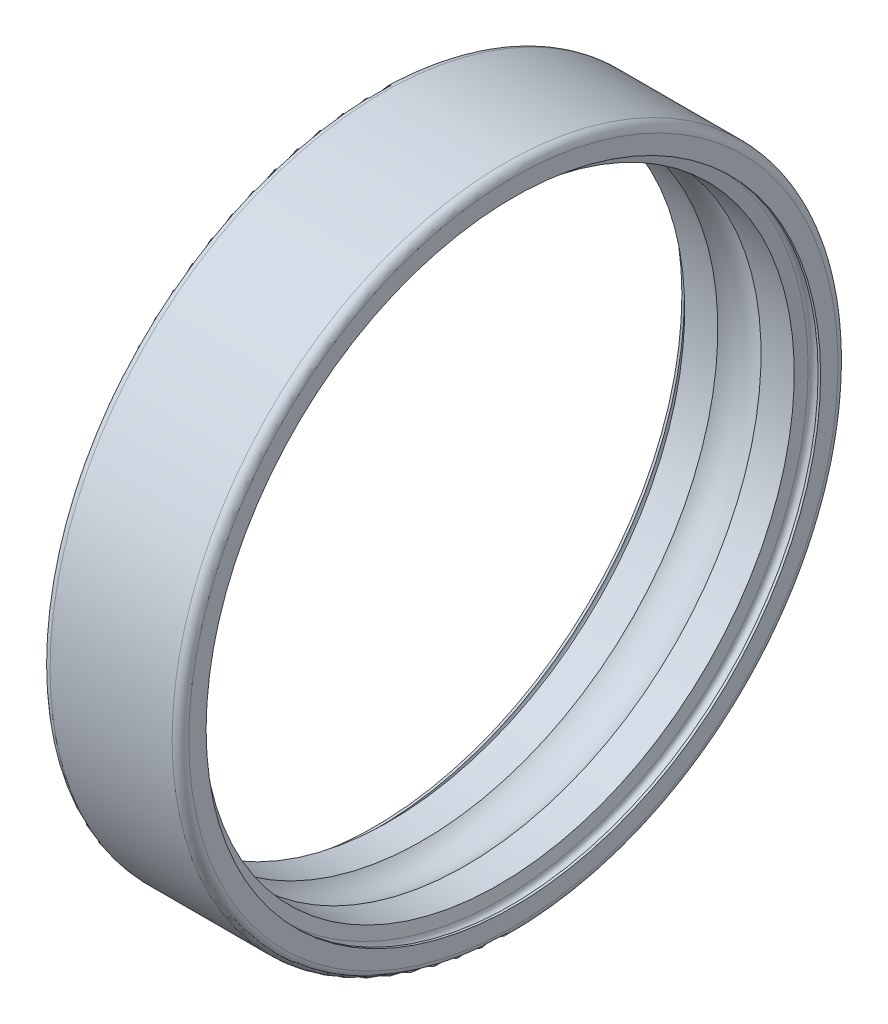
ISO-10303-21;
HEADER;
FILE_DESCRIPTION(('STEP AP214'),'2;1');
FILE_NAME('part.step','',(''),(''),'','','');
FILE_SCHEMA(('AUTOMOTIVE_DESIGN { 1 0 10303 214 1 1 1 1 }'));
ENDSEC;
DATA;
#1=APPLICATION_CONTEXT('core data for automotive mechanical design processes');
#2=APPLICATION_PROTOCOL_DEFINITION('international standard','automotive_design',2000,#1);
#3=PRODUCT_CONTEXT('',#1,'mechanical');
#4=PRODUCT('Part','Part','',(#3));
#5=PRODUCT_RELATED_PRODUCT_CATEGORY('part','',(#4));
#6=PRODUCT_DEFINITION_FORMATION('','',#4);
#7=PRODUCT_DEFINITION_CONTEXT('part definition',#1,'design');
#8=PRODUCT_DEFINITION('design','',#6,#7);
#9=PRODUCT_DEFINITION_SHAPE('','',#8);
#10=(LENGTH_UNIT() NAMED_UNIT(*) SI_UNIT(.MILLI.,.METRE.));
#11=(NAMED_UNIT(*) PLANE_ANGLE_UNIT() SI_UNIT($,.RADIAN.));
#12=(NAMED_UNIT(*) SI_UNIT($,.STERADIAN.) SOLID_ANGLE_UNIT());
#13=UNCERTAINTY_MEASURE_WITH_UNIT(LENGTH_MEASURE(1.E-05),#10,'distance_accuracy_value','');
#14=(GEOMETRIC_REPRESENTATION_CONTEXT(3) GLOBAL_UNCERTAINTY_ASSIGNED_CONTEXT((#13)) GLOBAL_UNIT_ASSIGNED_CONTEXT((#10,
#11,#12)) REPRESENTATION_CONTEXT('',''));
#15=CARTESIAN_POINT('',(0.,0.,0.));
#16=DIRECTION('',(0.,0.,1.));
#17=DIRECTION('',(1.,0.,0.));
#18=AXIS2_PLACEMENT_3D('',#15,#16,#17);
#19=CARTESIAN_POINT('',(0.,11.7,0.));
#20=DIRECTION('',(1.,0.,0.));
#21=DIRECTION('',(0.,0.,-1.));
#22=AXIS2_PLACEMENT_3D('',#19,#20,#21);
#23=PLANE('',#22);
#24=CARTESIAN_POINT('',(0.,0.,0.));
#25=DIRECTION('',(-1.,0.,0.));
#26=DIRECTION('',(0.,0.,1.));
#27=AXIS2_PLACEMENT_3D('',#24,#25,#26);
#28=CIRCLE('',#27,11.075);
#29=CARTESIAN_POINT('',(0.,0.,11.075));
#30=VERTEX_POINT('',#29);
#31=EDGE_CURVE('E79',#30,#30,#28,.T.);
#32=ORIENTED_EDGE('',*,*,#31,.F.);
#33=EDGE_LOOP('',(#32));
#34=FACE_BOUND('',#33,.T.);
#35=CARTESIAN_POINT('',(0.,0.,0.));
#36=DIRECTION('',(-1.,0.,0.));
#37=DIRECTION('',(0.,0.,1.));
#38=AXIS2_PLACEMENT_3D('',#35,#36,#37);
#39=CIRCLE('',#38,11.7);
#40=CARTESIAN_POINT('',(0.,0.,11.7));
#41=VERTEX_POINT('',#40);
#42=EDGE_CURVE('E10',#41,#41,#39,.T.);
#43=ORIENTED_EDGE('',*,*,#42,.T.);
#44=EDGE_LOOP('',(#43));
#45=FACE_BOUND('',#44,.T.);
#46=ADVANCED_FACE('F33',(#34,#45),#23,.F.);
#47=CARTESIAN_POINT('',(0.299999999999941,0.,0.));
#48=DIRECTION('',(-1.,0.,0.));
#49=DIRECTION('',(0.,0.,1.));
#50=AXIS2_PLACEMENT_3D('',#47,#48,#49);
#51=TOROIDAL_SURFACE('',#50,11.7000000000001,0.299999999999942);
#52=ORIENTED_EDGE('',*,*,#42,.F.);
#53=EDGE_LOOP('',(#52));
#54=FACE_BOUND('',#53,.T.);
#55=CARTESIAN_POINT('',(0.300000000000002,0.,0.));
#56=DIRECTION('',(-1.,0.,0.));
#57=DIRECTION('',(0.,0.,1.));
#58=AXIS2_PLACEMENT_3D('',#55,#56,#57);
#59=CIRCLE('',#58,12.);
#60=CARTESIAN_POINT('',(0.300000000000002,0.,12.));
#61=VERTEX_POINT('',#60);
#62=EDGE_CURVE('E39',#61,#61,#59,.T.);
#63=ORIENTED_EDGE('',*,*,#62,.T.);
#64=EDGE_LOOP('',(#63));
#65=FACE_BOUND('',#64,.T.);
#66=ADVANCED_FACE('F86',(#54,#65),#51,.T.);
#67=CARTESIAN_POINT('',(50.,0.,0.));
#68=DIRECTION('',(-1.,0.,0.));
#69=DIRECTION('',(0.,0.,1.));
#70=AXIS2_PLACEMENT_3D('',#67,#68,#69);
#71=CYLINDRICAL_SURFACE('',#70,12.);
#72=ORIENTED_EDGE('',*,*,#62,.F.);
#73=EDGE_LOOP('',(#72));
#74=FACE_BOUND('',#73,.T.);
#75=CARTESIAN_POINT('',(4.7,0.,0.));
#76=DIRECTION('',(-1.,0.,0.));
#77=DIRECTION('',(0.,0.,1.));
#78=AXIS2_PLACEMENT_3D('',#75,#76,#77);
#79=CIRCLE('',#78,12.);
#80=CARTESIAN_POINT('',(4.7,0.,12.));
#81=VERTEX_POINT('',#80);
#82=EDGE_CURVE('E43',#81,#81,#79,.T.);
#83=ORIENTED_EDGE('',*,*,#82,.T.);
#84=EDGE_LOOP('',(#83));
#85=FACE_BOUND('',#84,.T.);
#86=ADVANCED_FACE('F90',(#74,#85),#71,.T.);
#87=CARTESIAN_POINT('',(4.70000000000012,0.,0.));
#88=DIRECTION('',(-1.,0.,0.));
#89=DIRECTION('',(0.,0.,1.));
#90=AXIS2_PLACEMENT_3D('',#87,#88,#89);
#91=TOROIDAL_SURFACE('',#90,11.7000000000001,0.29999999999988);
#92=ORIENTED_EDGE('',*,*,#82,.F.);
#93=EDGE_LOOP('',(#92));
#94=FACE_BOUND('',#93,.T.);
#95=CARTESIAN_POINT('',(5.,0.,0.));
#96=DIRECTION('',(-1.,0.,0.));
#97=DIRECTION('',(0.,0.,1.));
#98=AXIS2_PLACEMENT_3D('',#95,#96,#97);
#99=CIRCLE('',#98,11.7);
#100=CARTESIAN_POINT('',(5.,0.,11.7));
#101=VERTEX_POINT('',#100);
#102=EDGE_CURVE('E47',#101,#101,#99,.T.);
#103=ORIENTED_EDGE('',*,*,#102,.T.);
#104=EDGE_LOOP('',(#103));
#105=FACE_BOUND('',#104,.T.);
#106=ADVANCED_FACE('F95',(#94,#105),#91,.T.);
#107=CARTESIAN_POINT('',(5.,11.075,0.));
#108=DIRECTION('',(-1.,0.,0.));
#109=DIRECTION('',(0.,0.,1.));
#110=AXIS2_PLACEMENT_3D('',#107,#108,#109);
#111=PLANE('',#110);
#112=ORIENTED_EDGE('',*,*,#102,.F.);
#113=EDGE_LOOP('',(#112));
#114=FACE_BOUND('',#113,.T.);
#115=CARTESIAN_POINT('',(5.,0.,0.));
#116=DIRECTION('',(-1.,0.,0.));
#117=DIRECTION('',(0.,0.,1.));
#118=AXIS2_PLACEMENT_3D('',#115,#116,#117);
#119=CIRCLE('',#118,11.075);
#120=CARTESIAN_POINT('',(5.,0.,11.075));
#121=VERTEX_POINT('',#120);
#122=EDGE_CURVE('E52',#121,#121,#119,.T.);
#123=ORIENTED_EDGE('',*,*,#122,.T.);
#124=EDGE_LOOP('',(#123));
#125=FACE_BOUND('',#124,.T.);
#126=ADVANCED_FACE('F101',(#114,#125),#111,.F.);
#127=CARTESIAN_POINT('',(50.,0.,0.));
#128=DIRECTION('',(-1.,0.,0.));
#129=DIRECTION('',(0.,0.,1.));
#130=AXIS2_PLACEMENT_3D('',#127,#128,#129);
#131=CYLINDRICAL_SURFACE('',#130,11.075);
#132=ORIENTED_EDGE('',*,*,#122,.F.);
#133=EDGE_LOOP('',(#132));
#134=FACE_BOUND('',#133,.T.);
#135=CARTESIAN_POINT('',(4.91,0.,0.));
#136=DIRECTION('',(-1.,0.,0.));
#137=DIRECTION('',(0.,0.,1.));
#138=AXIS2_PLACEMENT_3D('',#135,#136,#137);
#139=CIRCLE('',#138,11.075);
#140=CARTESIAN_POINT('',(4.91,0.,11.075));
#141=VERTEX_POINT('',#140);
#142=EDGE_CURVE('E55',#141,#141,#139,.T.);
#143=ORIENTED_EDGE('',*,*,#142,.T.);
#144=EDGE_LOOP('',(#143));
#145=FACE_BOUND('',#144,.T.);
#146=ADVANCED_FACE('F105',(#134,#145),#131,.F.);
#147=CARTESIAN_POINT('',(4.73,0.,0.));
#148=DIRECTION('',(-1.,0.,0.));
#149=DIRECTION('',(0.,0.,1.));
#150=AXIS2_PLACEMENT_3D('',#147,#148,#149);
#151=TOROIDAL_SURFACE('',#150,11.075,0.18);
#152=ORIENTED_EDGE('',*,*,#142,.F.);
#153=EDGE_LOOP('',(#152));
#154=FACE_BOUND('',#153,.T.);
#155=CARTESIAN_POINT('',(4.55,0.,0.));
#156=DIRECTION('',(-1.,0.,0.));
#157=DIRECTION('',(0.,0.,1.));
#158=AXIS2_PLACEMENT_3D('',#155,#156,#157);
#159=CIRCLE('',#158,11.075);
#160=CARTESIAN_POINT('',(4.55,0.,11.075));
#161=VERTEX_POINT('',#160);
#162=EDGE_CURVE('E58',#161,#161,#159,.T.);
#163=ORIENTED_EDGE('',*,*,#162,.T.);
#164=EDGE_LOOP('',(#163));
#165=FACE_BOUND('',#164,.T.);
#166=ADVANCED_FACE('F109',(#154,#165),#151,.F.);
#167=CARTESIAN_POINT('',(4.4750610331989,0.,0.));
#168=DIRECTION('',(1.,0.,0.));
#169=DIRECTION('',(0.,0.,-1.));
#170=AXIS2_PLACEMENT_3D('',#167,#168,#169);
#171=CONICAL_SURFACE('',#170,10.65,1.39626340159546);
#172=ORIENTED_EDGE('',*,*,#162,.F.);
#173=EDGE_LOOP('',(#172));
#174=FACE_BOUND('',#173,.T.);
#175=CARTESIAN_POINT('',(4.4750610331989,0.,0.));
#176=DIRECTION('',(-1.,0.,0.));
#177=DIRECTION('',(0.,0.,1.));
#178=AXIS2_PLACEMENT_3D('',#175,#176,#177);
#179=CIRCLE('',#178,10.65);
#180=CARTESIAN_POINT('',(4.4750610331989,0.,10.65));
#181=VERTEX_POINT('',#180);
#182=EDGE_CURVE('E61',#181,#181,#179,.T.);
#183=ORIENTED_EDGE('',*,*,#182,.T.);
#184=EDGE_LOOP('',(#183));
#185=FACE_BOUND('',#184,.T.);
#186=ADVANCED_FACE('F113',(#174,#185),#171,.F.);
#187=CARTESIAN_POINT('',(50.,0.,0.));
#188=DIRECTION('',(-1.,0.,0.));
#189=DIRECTION('',(0.,0.,1.));
#190=AXIS2_PLACEMENT_3D('',#187,#188,#189);
#191=CYLINDRICAL_SURFACE('',#190,10.65);
#192=ORIENTED_EDGE('',*,*,#182,.F.);
#193=EDGE_LOOP('',(#192));
#194=FACE_BOUND('',#193,.T.);
#195=CARTESIAN_POINT('',(3.2792882971019,0.,0.));
#196=DIRECTION('',(-1.,0.,0.));
#197=DIRECTION('',(0.,0.,1.));
#198=AXIS2_PLACEMENT_3D('',#195,#196,#197);
#199=CIRCLE('',#198,10.65);
#200=CARTESIAN_POINT('',(3.2792882971019,0.,10.65));
#201=VERTEX_POINT('',#200);
#202=EDGE_CURVE('E64',#201,#201,#199,.T.);
#203=ORIENTED_EDGE('',*,*,#202,.T.);
#204=EDGE_LOOP('',(#203));
#205=FACE_BOUND('',#204,.T.);
#206=ADVANCED_FACE('F117',(#194,#205),#191,.F.);
#207=CARTESIAN_POINT('',(2.5,0.,0.));
#208=DIRECTION('',(-1.,0.,0.));
#209=DIRECTION('',(0.,0.,1.));
#210=AXIS2_PLACEMENT_3D('',#207,#208,#209);
#211=TOROIDAL_SURFACE('',#210,9.75000000000004,1.19049999999996);
#212=ORIENTED_EDGE('',*,*,#202,.F.);
#213=EDGE_LOOP('',(#212));
#214=FACE_BOUND('',#213,.T.);
#215=CARTESIAN_POINT('',(1.7207117028981,0.,0.));
#216=DIRECTION('',(-1.,0.,0.));
#217=DIRECTION('',(0.,0.,1.));
#218=AXIS2_PLACEMENT_3D('',#215,#216,#217);
#219=CIRCLE('',#218,10.65);
#220=CARTESIAN_POINT('',(1.7207117028981,0.,10.65));
#221=VERTEX_POINT('',#220);
#222=EDGE_CURVE('E67',#221,#221,#219,.T.);
#223=ORIENTED_EDGE('',*,*,#222,.T.);
#224=EDGE_LOOP('',(#223));
#225=FACE_BOUND('',#224,.T.);
#226=ADVANCED_FACE('F121',(#214,#225),#211,.F.);
#227=CARTESIAN_POINT('',(50.,0.,0.));
#228=DIRECTION('',(-1.,0.,0.));
#229=DIRECTION('',(0.,0.,1.));
#230=AXIS2_PLACEMENT_3D('',#227,#228,#229);
#231=CYLINDRICAL_SURFACE('',#230,10.65);
#232=ORIENTED_EDGE('',*,*,#222,.F.);
#233=EDGE_LOOP('',(#232));
#234=FACE_BOUND('',#233,.T.);
#235=CARTESIAN_POINT('',(0.5249389668011,0.,0.));
#236=DIRECTION('',(-1.,0.,0.));
#237=DIRECTION('',(0.,0.,1.));
#238=AXIS2_PLACEMENT_3D('',#235,#236,#237);
#239=CIRCLE('',#238,10.65);
#240=CARTESIAN_POINT('',(0.5249389668011,0.,10.65));
#241=VERTEX_POINT('',#240);
#242=EDGE_CURVE('E70',#241,#241,#239,.T.);
#243=ORIENTED_EDGE('',*,*,#242,.T.);
#244=EDGE_LOOP('',(#243));
#245=FACE_BOUND('',#244,.T.);
#246=ADVANCED_FACE('F125',(#234,#245),#231,.F.);
#247=CARTESIAN_POINT('',(0.449999999999999,0.,0.));
#248=DIRECTION('',(-1.,0.,0.));
#249=DIRECTION('',(0.,0.,1.));
#250=AXIS2_PLACEMENT_3D('',#247,#248,#249);
#251=CONICAL_SURFACE('',#250,11.075,1.39626340159546);
#252=ORIENTED_EDGE('',*,*,#242,.F.);
#253=EDGE_LOOP('',(#252));
#254=FACE_BOUND('',#253,.T.);
#255=CARTESIAN_POINT('',(0.449999999999999,0.,0.));
#256=DIRECTION('',(-1.,0.,0.));
#257=DIRECTION('',(0.,0.,1.));
#258=AXIS2_PLACEMENT_3D('',#255,#256,#257);
#259=CIRCLE('',#258,11.075);
#260=CARTESIAN_POINT('',(0.449999999999999,0.,11.075));
#261=VERTEX_POINT('',#260);
#262=EDGE_CURVE('E73',#261,#261,#259,.T.);
#263=ORIENTED_EDGE('',*,*,#262,.T.);
#264=EDGE_LOOP('',(#263));
#265=FACE_BOUND('',#264,.T.);
#266=ADVANCED_FACE('F129',(#254,#265),#251,.F.);
#267=CARTESIAN_POINT('',(0.27,0.,0.));
#268=DIRECTION('',(-1.,0.,0.));
#269=DIRECTION('',(0.,0.,1.));
#270=AXIS2_PLACEMENT_3D('',#267,#268,#269);
#271=TOROIDAL_SURFACE('',#270,11.075,0.18);
#272=ORIENTED_EDGE('',*,*,#262,.F.);
#273=EDGE_LOOP('',(#272));
#274=FACE_BOUND('',#273,.T.);
#275=CARTESIAN_POINT('',(0.0899999999999998,0.,0.));
#276=DIRECTION('',(-1.,0.,0.));
#277=DIRECTION('',(0.,0.,1.));
#278=AXIS2_PLACEMENT_3D('',#275,#276,#277);
#279=CIRCLE('',#278,11.075);
#280=CARTESIAN_POINT('',(0.0899999999999998,0.,11.075));
#281=VERTEX_POINT('',#280);
#282=EDGE_CURVE('E76',#281,#281,#279,.T.);
#283=ORIENTED_EDGE('',*,*,#282,.T.);
#284=EDGE_LOOP('',(#283));
#285=FACE_BOUND('',#284,.T.);
#286=ADVANCED_FACE('F133',(#274,#285),#271,.F.);
#287=CARTESIAN_POINT('',(50.,0.,0.));
#288=DIRECTION('',(-1.,0.,0.));
#289=DIRECTION('',(0.,0.,1.));
#290=AXIS2_PLACEMENT_3D('',#287,#288,#289);
#291=CYLINDRICAL_SURFACE('',#290,11.075);
#292=ORIENTED_EDGE('',*,*,#282,.F.);
#293=EDGE_LOOP('',(#292));
#294=FACE_BOUND('',#293,.T.);
#295=ORIENTED_EDGE('',*,*,#31,.T.);
#296=EDGE_LOOP('',(#295));
#297=FACE_BOUND('',#296,.T.);
#298=ADVANCED_FACE('F83',(#294,#297),#291,.F.);
#299=CLOSED_SHELL('',(#46,#66,#86,#106,#126,#146,#166,#186,#206,#226,#246,#266,#286,#298));
#300=MANIFOLD_SOLID_BREP('B2',#299);
#301=ADVANCED_BREP_SHAPE_REPRESENTATION('',(#18,#300),#14);
#302=SHAPE_DEFINITION_REPRESENTATION(#9,#301);
ENDSEC;
END-ISO-10303-21;
